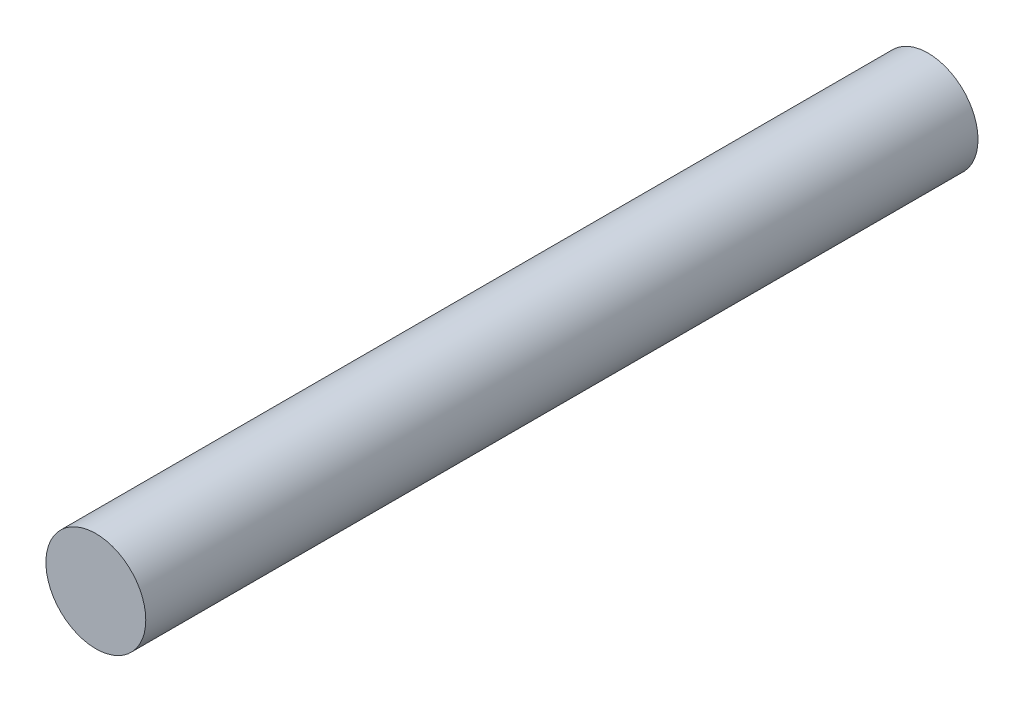
ISO-10303-21;
HEADER;
FILE_DESCRIPTION(('STEP AP214'),'2;1');
FILE_NAME('part.step','',(''),(''),'','','');
FILE_SCHEMA(('AUTOMOTIVE_DESIGN { 1 0 10303 214 1 1 1 1 }'));
ENDSEC;
DATA;
#1=APPLICATION_CONTEXT('core data for automotive mechanical design processes');
#2=APPLICATION_PROTOCOL_DEFINITION('international standard','automotive_design',2000,#1);
#3=PRODUCT_CONTEXT('',#1,'mechanical');
#4=PRODUCT('Part','Part','',(#3));
#5=PRODUCT_RELATED_PRODUCT_CATEGORY('part','',(#4));
#6=PRODUCT_DEFINITION_FORMATION('','',#4);
#7=PRODUCT_DEFINITION_CONTEXT('part definition',#1,'design');
#8=PRODUCT_DEFINITION('design','',#6,#7);
#9=PRODUCT_DEFINITION_SHAPE('','',#8);
#10=(LENGTH_UNIT() NAMED_UNIT(*) SI_UNIT(.MILLI.,.METRE.));
#11=(NAMED_UNIT(*) PLANE_ANGLE_UNIT() SI_UNIT($,.RADIAN.));
#12=(NAMED_UNIT(*) SI_UNIT($,.STERADIAN.) SOLID_ANGLE_UNIT());
#13=UNCERTAINTY_MEASURE_WITH_UNIT(LENGTH_MEASURE(1.E-05),#10,'distance_accuracy_value','');
#14=(GEOMETRIC_REPRESENTATION_CONTEXT(3) GLOBAL_UNCERTAINTY_ASSIGNED_CONTEXT((#13)) GLOBAL_UNIT_ASSIGNED_CONTEXT((#10,
#11,#12)) REPRESENTATION_CONTEXT('',''));
#15=CARTESIAN_POINT('',(0.,0.,0.));
#16=DIRECTION('',(0.,0.,1.));
#17=DIRECTION('',(1.,0.,0.));
#18=AXIS2_PLACEMENT_3D('',#15,#16,#17);
#19=CARTESIAN_POINT('',(0.,0.,50.));
#20=DIRECTION('',(0.,0.,-1.));
#21=DIRECTION('',(-1.,0.,0.));
#22=AXIS2_PLACEMENT_3D('',#19,#20,#21);
#23=CYLINDRICAL_SURFACE('',#22,3.);
#24=CARTESIAN_POINT('',(0.,0.,50.));
#25=DIRECTION('',(0.,0.,1.));
#26=DIRECTION('',(1.,0.,0.));
#27=AXIS2_PLACEMENT_3D('',#24,#25,#26);
#28=CIRCLE('',#27,3.);
#29=CARTESIAN_POINT('',(3.,0.,50.));
#30=VERTEX_POINT('',#29);
#31=EDGE_CURVE('E10',#30,#30,#28,.T.);
#32=ORIENTED_EDGE('',*,*,#31,.F.);
#33=EDGE_LOOP('',(#32));
#34=FACE_BOUND('',#33,.T.);
#35=CARTESIAN_POINT('',(0.,0.,0.));
#36=DIRECTION('',(0.,0.,1.));
#37=DIRECTION('',(1.,0.,0.));
#38=AXIS2_PLACEMENT_3D('',#35,#36,#37);
#39=CIRCLE('',#38,3.);
#40=CARTESIAN_POINT('',(3.,0.,0.));
#41=VERTEX_POINT('',#40);
#42=EDGE_CURVE('E33',#41,#41,#39,.T.);
#43=ORIENTED_EDGE('',*,*,#42,.T.);
#44=EDGE_LOOP('',(#43));
#45=FACE_BOUND('',#44,.T.);
#46=ADVANCED_FACE('F30',(#34,#45),#23,.T.);
#47=CARTESIAN_POINT('',(0.,0.,50.));
#48=DIRECTION('',(0.,0.,1.));
#49=DIRECTION('',(1.,0.,0.));
#50=AXIS2_PLACEMENT_3D('',#47,#48,#49);
#51=PLANE('',#50);
#52=ORIENTED_EDGE('',*,*,#31,.T.);
#53=EDGE_LOOP('',(#52));
#54=FACE_BOUND('',#53,.T.);
#55=ADVANCED_FACE('F45',(#54),#51,.T.);
#56=CARTESIAN_POINT('',(0.,0.,0.));
#57=DIRECTION('',(0.,0.,1.));
#58=DIRECTION('',(1.,0.,0.));
#59=AXIS2_PLACEMENT_3D('',#56,#57,#58);
#60=PLANE('',#59);
#61=ORIENTED_EDGE('',*,*,#42,.F.);
#62=EDGE_LOOP('',(#61));
#63=FACE_BOUND('',#62,.T.);
#64=ADVANCED_FACE('F43',(#63),#60,.F.);
#65=CLOSED_SHELL('',(#46,#55,#64));
#66=MANIFOLD_SOLID_BREP('B2',#65);
#67=ADVANCED_BREP_SHAPE_REPRESENTATION('',(#18,#66),#14);
#68=SHAPE_DEFINITION_REPRESENTATION(#9,#67);
ENDSEC;
END-ISO-10303-21;
